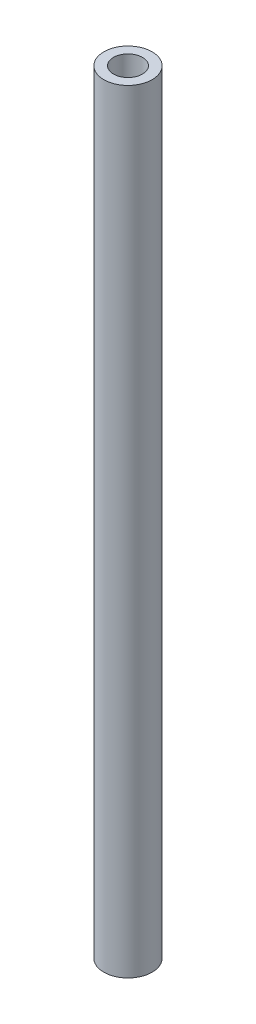
ISO-10303-21;
HEADER;
FILE_DESCRIPTION(('STEP AP214'),'2;1');
FILE_NAME('part.step','',(''),(''),'','','');
FILE_SCHEMA(('AUTOMOTIVE_DESIGN { 1 0 10303 214 1 1 1 1 }'));
ENDSEC;
DATA;
#1=APPLICATION_CONTEXT('core data for automotive mechanical design processes');
#2=APPLICATION_PROTOCOL_DEFINITION('international standard','automotive_design',2000,#1);
#3=PRODUCT_CONTEXT('',#1,'mechanical');
#4=PRODUCT('Part','Part','',(#3));
#5=PRODUCT_RELATED_PRODUCT_CATEGORY('part','',(#4));
#6=PRODUCT_DEFINITION_FORMATION('','',#4);
#7=PRODUCT_DEFINITION_CONTEXT('part definition',#1,'design');
#8=PRODUCT_DEFINITION('design','',#6,#7);
#9=PRODUCT_DEFINITION_SHAPE('','',#8);
#10=(LENGTH_UNIT() NAMED_UNIT(*) SI_UNIT(.MILLI.,.METRE.));
#11=(NAMED_UNIT(*) PLANE_ANGLE_UNIT() SI_UNIT($,.RADIAN.));
#12=(NAMED_UNIT(*) SI_UNIT($,.STERADIAN.) SOLID_ANGLE_UNIT());
#13=UNCERTAINTY_MEASURE_WITH_UNIT(LENGTH_MEASURE(1.E-05),#10,'distance_accuracy_value','');
#14=(GEOMETRIC_REPRESENTATION_CONTEXT(3) GLOBAL_UNCERTAINTY_ASSIGNED_CONTEXT((#13)) GLOBAL_UNIT_ASSIGNED_CONTEXT((#10,
#11,#12)) REPRESENTATION_CONTEXT('',''));
#15=CARTESIAN_POINT('',(0.,0.,0.));
#16=DIRECTION('',(0.,0.,1.));
#17=DIRECTION('',(1.,0.,0.));
#18=AXIS2_PLACEMENT_3D('',#15,#16,#17);
#19=CARTESIAN_POINT('',(0.,80.,0.));
#20=DIRECTION('',(0.,1.,0.));
#21=DIRECTION('',(0.,0.,1.));
#22=AXIS2_PLACEMENT_3D('',#19,#20,#21);
#23=PLANE('',#22);
#24=CARTESIAN_POINT('',(0.,80.,0.));
#25=DIRECTION('',(0.,1.,0.));
#26=DIRECTION('',(0.,0.,1.));
#27=AXIS2_PLACEMENT_3D('',#24,#25,#26);
#28=CIRCLE('',#27,2.5);
#29=CARTESIAN_POINT('',(0.,80.,2.5));
#30=VERTEX_POINT('',#29);
#31=EDGE_CURVE('E10',#30,#30,#28,.T.);
#32=ORIENTED_EDGE('',*,*,#31,.T.);
#33=EDGE_LOOP('',(#32));
#34=FACE_BOUND('',#33,.T.);
#35=CARTESIAN_POINT('',(0.,80.,0.));
#36=DIRECTION('',(0.,1.,0.));
#37=DIRECTION('',(0.,0.,1.));
#38=AXIS2_PLACEMENT_3D('',#35,#36,#37);
#39=CIRCLE('',#38,1.5);
#40=CARTESIAN_POINT('',(0.,80.,1.5));
#41=VERTEX_POINT('',#40);
#42=EDGE_CURVE('E41',#41,#41,#39,.T.);
#43=ORIENTED_EDGE('',*,*,#42,.F.);
#44=EDGE_LOOP('',(#43));
#45=FACE_BOUND('',#44,.T.);
#46=ADVANCED_FACE('F30',(#34,#45),#23,.T.);
#47=CARTESIAN_POINT('',(0.,0.,0.));
#48=DIRECTION('',(0.,1.,0.));
#49=DIRECTION('',(0.,0.,1.));
#50=AXIS2_PLACEMENT_3D('',#47,#48,#49);
#51=PLANE('',#50);
#52=CARTESIAN_POINT('',(0.,0.,0.));
#53=DIRECTION('',(0.,1.,0.));
#54=DIRECTION('',(0.,0.,1.));
#55=AXIS2_PLACEMENT_3D('',#52,#53,#54);
#56=CIRCLE('',#55,2.5);
#57=CARTESIAN_POINT('',(0.,0.,2.5));
#58=VERTEX_POINT('',#57);
#59=EDGE_CURVE('E34',#58,#58,#56,.T.);
#60=ORIENTED_EDGE('',*,*,#59,.F.);
#61=EDGE_LOOP('',(#60));
#62=FACE_BOUND('',#61,.T.);
#63=CARTESIAN_POINT('',(0.,0.,0.));
#64=DIRECTION('',(0.,1.,0.));
#65=DIRECTION('',(0.,0.,1.));
#66=AXIS2_PLACEMENT_3D('',#63,#64,#65);
#67=CIRCLE('',#66,1.5);
#68=CARTESIAN_POINT('',(0.,0.,1.5));
#69=VERTEX_POINT('',#68);
#70=EDGE_CURVE('E43',#69,#69,#67,.T.);
#71=ORIENTED_EDGE('',*,*,#70,.T.);
#72=EDGE_LOOP('',(#71));
#73=FACE_BOUND('',#72,.T.);
#74=ADVANCED_FACE('F53',(#62,#73),#51,.F.);
#75=CARTESIAN_POINT('',(0.,80.,0.));
#76=DIRECTION('',(0.,-1.,0.));
#77=DIRECTION('',(0.,0.,-1.));
#78=AXIS2_PLACEMENT_3D('',#75,#76,#77);
#79=CYLINDRICAL_SURFACE('',#78,2.5);
#80=ORIENTED_EDGE('',*,*,#31,.F.);
#81=EDGE_LOOP('',(#80));
#82=FACE_BOUND('',#81,.T.);
#83=ORIENTED_EDGE('',*,*,#59,.T.);
#84=EDGE_LOOP('',(#83));
#85=FACE_BOUND('',#84,.T.);
#86=ADVANCED_FACE('F32',(#82,#85),#79,.T.);
#87=CARTESIAN_POINT('',(0.,80.,0.));
#88=DIRECTION('',(0.,-1.,0.));
#89=DIRECTION('',(0.,0.,-1.));
#90=AXIS2_PLACEMENT_3D('',#87,#88,#89);
#91=CYLINDRICAL_SURFACE('',#90,1.5);
#92=ORIENTED_EDGE('',*,*,#42,.T.);
#93=EDGE_LOOP('',(#92));
#94=FACE_BOUND('',#93,.T.);
#95=ORIENTED_EDGE('',*,*,#70,.F.);
#96=EDGE_LOOP('',(#95));
#97=FACE_BOUND('',#96,.T.);
#98=ADVANCED_FACE('F49',(#94,#97),#91,.F.);
#99=CLOSED_SHELL('',(#46,#74,#86,#98));
#100=MANIFOLD_SOLID_BREP('B2',#99);
#101=ADVANCED_BREP_SHAPE_REPRESENTATION('',(#18,#100),#14);
#102=SHAPE_DEFINITION_REPRESENTATION(#9,#101);
ENDSEC;
END-ISO-10303-21;
